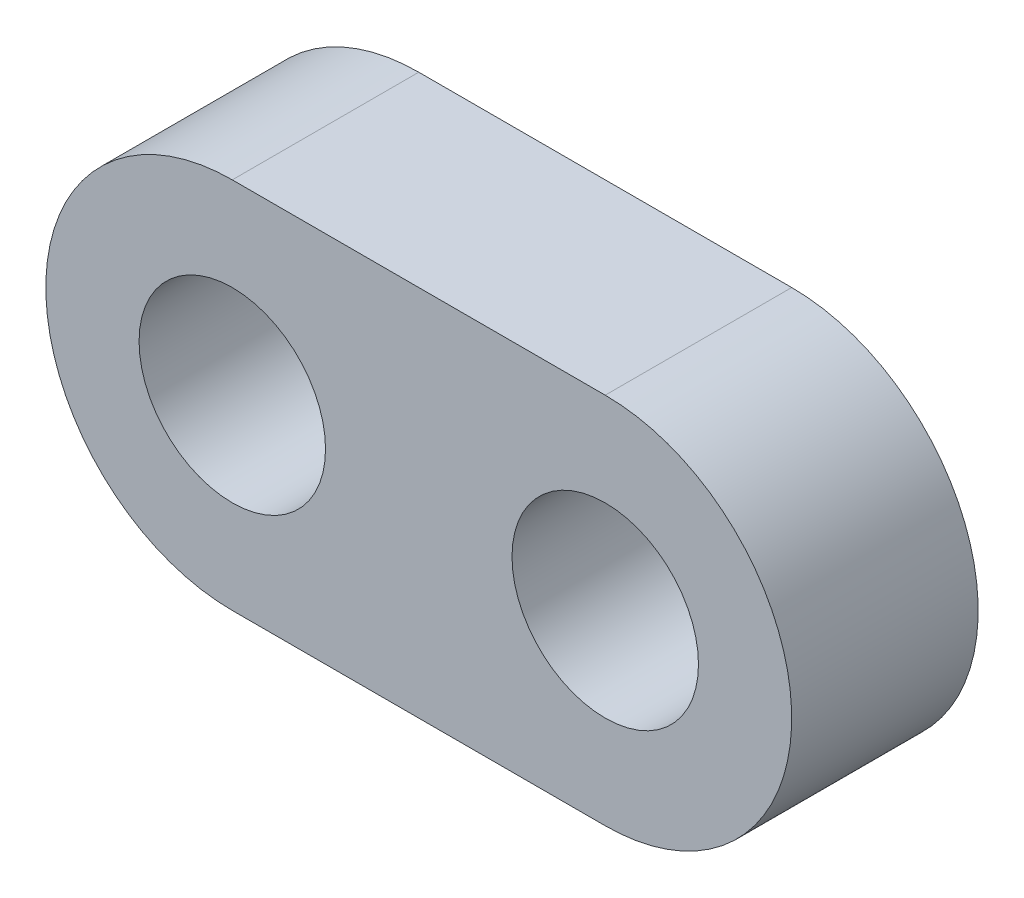
ISO-10303-21;
HEADER;
FILE_DESCRIPTION(('STEP AP214'),'2;1');
FILE_NAME('part.step','',(''),(''),'','','');
FILE_SCHEMA(('AUTOMOTIVE_DESIGN { 1 0 10303 214 1 1 1 1 }'));
ENDSEC;
DATA;
#1=APPLICATION_CONTEXT('core data for automotive mechanical design processes');
#2=APPLICATION_PROTOCOL_DEFINITION('international standard','automotive_design',2000,#1);
#3=PRODUCT_CONTEXT('',#1,'mechanical');
#4=PRODUCT('Part','Part','',(#3));
#5=PRODUCT_RELATED_PRODUCT_CATEGORY('part','',(#4));
#6=PRODUCT_DEFINITION_FORMATION('','',#4);
#7=PRODUCT_DEFINITION_CONTEXT('part definition',#1,'design');
#8=PRODUCT_DEFINITION('design','',#6,#7);
#9=PRODUCT_DEFINITION_SHAPE('','',#8);
#10=(LENGTH_UNIT() NAMED_UNIT(*) SI_UNIT(.MILLI.,.METRE.));
#11=(NAMED_UNIT(*) PLANE_ANGLE_UNIT() SI_UNIT($,.RADIAN.));
#12=(NAMED_UNIT(*) SI_UNIT($,.STERADIAN.) SOLID_ANGLE_UNIT());
#13=UNCERTAINTY_MEASURE_WITH_UNIT(LENGTH_MEASURE(1.E-05),#10,'distance_accuracy_value','');
#14=(GEOMETRIC_REPRESENTATION_CONTEXT(3) GLOBAL_UNCERTAINTY_ASSIGNED_CONTEXT((#13)) GLOBAL_UNIT_ASSIGNED_CONTEXT((#10,
#11,#12)) REPRESENTATION_CONTEXT('',''));
#15=CARTESIAN_POINT('',(0.,0.,0.));
#16=DIRECTION('',(0.,0.,1.));
#17=DIRECTION('',(1.,0.,0.));
#18=AXIS2_PLACEMENT_3D('',#15,#16,#17);
#19=CARTESIAN_POINT('',(0.,0.,6.35));
#20=DIRECTION('',(0.,0.,-1.));
#21=DIRECTION('',(-1.,0.,0.));
#22=AXIS2_PLACEMENT_3D('',#19,#20,#21);
#23=PLANE('',#22);
#24=CARTESIAN_POINT('',(0.,0.,6.35));
#25=DIRECTION('',(0.,0.,1.));
#26=DIRECTION('',(-1.,0.,0.));
#27=AXIS2_PLACEMENT_3D('',#24,#25,#26);
#28=CIRCLE('',#27,6.35);
#29=CARTESIAN_POINT('',(0.,-6.35,6.35));
#30=VERTEX_POINT('',#29);
#31=CARTESIAN_POINT('',(0.,6.35,6.35));
#32=VERTEX_POINT('',#31);
#33=EDGE_CURVE('E95',#30,#32,#28,.T.);
#34=ORIENTED_EDGE('',*,*,#33,.T.);
#35=DIRECTION('',(-1.,0.,0.));
#36=VECTOR('',#35,1.);
#37=CARTESIAN_POINT('',(0.,6.35,6.35));
#38=LINE('',#37,#36);
#39=CARTESIAN_POINT('',(-12.7,6.35,6.35));
#40=VERTEX_POINT('',#39);
#41=EDGE_CURVE('E90',#32,#40,#38,.T.);
#42=ORIENTED_EDGE('',*,*,#41,.T.);
#43=CARTESIAN_POINT('',(-12.7,0.,6.35));
#44=DIRECTION('',(0.,0.,1.));
#45=DIRECTION('',(1.,0.,0.));
#46=AXIS2_PLACEMENT_3D('',#43,#44,#45);
#47=CIRCLE('',#46,6.35);
#48=CARTESIAN_POINT('',(-12.7,-6.35,6.35));
#49=VERTEX_POINT('',#48);
#50=EDGE_CURVE('E93',#40,#49,#47,.T.);
#51=ORIENTED_EDGE('',*,*,#50,.T.);
#52=DIRECTION('',(1.,0.,0.));
#53=VECTOR('',#52,1.);
#54=CARTESIAN_POINT('',(-12.7,-6.35,6.35));
#55=LINE('',#54,#53);
#56=EDGE_CURVE('E60',#49,#30,#55,.T.);
#57=ORIENTED_EDGE('',*,*,#56,.T.);
#58=EDGE_LOOP('',(#34,#42,#51,#57));
#59=FACE_BOUND('',#58,.T.);
#60=CARTESIAN_POINT('',(0.,0.,6.35));
#61=DIRECTION('',(0.,0.,1.));
#62=DIRECTION('',(1.,0.,0.));
#63=AXIS2_PLACEMENT_3D('',#60,#61,#62);
#64=CIRCLE('',#63,3.175);
#65=CARTESIAN_POINT('',(3.175,0.,6.35));
#66=VERTEX_POINT('',#65);
#67=EDGE_CURVE('E110',#66,#66,#64,.T.);
#68=ORIENTED_EDGE('',*,*,#67,.F.);
#69=EDGE_LOOP('',(#68));
#70=FACE_BOUND('',#69,.T.);
#71=CARTESIAN_POINT('',(-12.7,0.,6.35));
#72=DIRECTION('',(0.,0.,1.));
#73=DIRECTION('',(1.,0.,0.));
#74=AXIS2_PLACEMENT_3D('',#71,#72,#73);
#75=CIRCLE('',#74,3.175);
#76=CARTESIAN_POINT('',(-9.525,0.,6.35));
#77=VERTEX_POINT('',#76);
#78=EDGE_CURVE('E125',#77,#77,#75,.T.);
#79=ORIENTED_EDGE('',*,*,#78,.F.);
#80=EDGE_LOOP('',(#79));
#81=FACE_BOUND('',#80,.T.);
#82=ADVANCED_FACE('F43',(#59,#70,#81),#23,.F.);
#83=CARTESIAN_POINT('',(0.,0.,0.));
#84=DIRECTION('',(0.,0.,-1.));
#85=DIRECTION('',(-1.,0.,0.));
#86=AXIS2_PLACEMENT_3D('',#83,#84,#85);
#87=PLANE('',#86);
#88=CARTESIAN_POINT('',(0.,0.,0.));
#89=DIRECTION('',(0.,0.,1.));
#90=DIRECTION('',(1.,0.,0.));
#91=AXIS2_PLACEMENT_3D('',#88,#89,#90);
#92=CIRCLE('',#91,3.175);
#93=CARTESIAN_POINT('',(3.175,0.,0.));
#94=VERTEX_POINT('',#93);
#95=EDGE_CURVE('E122',#94,#94,#92,.T.);
#96=ORIENTED_EDGE('',*,*,#95,.T.);
#97=EDGE_LOOP('',(#96));
#98=FACE_BOUND('',#97,.T.);
#99=CARTESIAN_POINT('',(0.,0.,0.));
#100=DIRECTION('',(0.,0.,1.));
#101=DIRECTION('',(-1.,0.,0.));
#102=AXIS2_PLACEMENT_3D('',#99,#100,#101);
#103=CIRCLE('',#102,6.35);
#104=CARTESIAN_POINT('',(0.,-6.35,0.));
#105=VERTEX_POINT('',#104);
#106=CARTESIAN_POINT('',(0.,6.35,0.));
#107=VERTEX_POINT('',#106);
#108=EDGE_CURVE('E107',#105,#107,#103,.T.);
#109=ORIENTED_EDGE('',*,*,#108,.F.);
#110=DIRECTION('',(1.,0.,0.));
#111=VECTOR('',#110,1.);
#112=CARTESIAN_POINT('',(-12.7,-6.35,0.));
#113=LINE('',#112,#111);
#114=CARTESIAN_POINT('',(-12.7,-6.35,0.));
#115=VERTEX_POINT('',#114);
#116=EDGE_CURVE('E83',#115,#105,#113,.T.);
#117=ORIENTED_EDGE('',*,*,#116,.F.);
#118=CARTESIAN_POINT('',(-12.7,0.,0.));
#119=DIRECTION('',(0.,0.,1.));
#120=DIRECTION('',(1.,0.,0.));
#121=AXIS2_PLACEMENT_3D('',#118,#119,#120);
#122=CIRCLE('',#121,6.35);
#123=CARTESIAN_POINT('',(-12.7,6.35,0.));
#124=VERTEX_POINT('',#123);
#125=EDGE_CURVE('E77',#124,#115,#122,.T.);
#126=ORIENTED_EDGE('',*,*,#125,.F.);
#127=DIRECTION('',(-1.,0.,0.));
#128=VECTOR('',#127,1.);
#129=CARTESIAN_POINT('',(0.,6.35,0.));
#130=LINE('',#129,#128);
#131=EDGE_CURVE('E99',#107,#124,#130,.T.);
#132=ORIENTED_EDGE('',*,*,#131,.F.);
#133=EDGE_LOOP('',(#109,#117,#126,#132));
#134=FACE_BOUND('',#133,.T.);
#135=CARTESIAN_POINT('',(-12.7,0.,0.));
#136=DIRECTION('',(0.,0.,1.));
#137=DIRECTION('',(1.,0.,0.));
#138=AXIS2_PLACEMENT_3D('',#135,#136,#137);
#139=CIRCLE('',#138,3.175);
#140=CARTESIAN_POINT('',(-9.525,0.,0.));
#141=VERTEX_POINT('',#140);
#142=EDGE_CURVE('E128',#141,#141,#139,.T.);
#143=ORIENTED_EDGE('',*,*,#142,.T.);
#144=EDGE_LOOP('',(#143));
#145=FACE_BOUND('',#144,.T.);
#146=ADVANCED_FACE('F118',(#98,#134,#145),#87,.T.);
#147=CARTESIAN_POINT('',(0.,0.,6.35));
#148=DIRECTION('',(0.,0.,-1.));
#149=DIRECTION('',(-1.,0.,0.));
#150=AXIS2_PLACEMENT_3D('',#147,#148,#149);
#151=CYLINDRICAL_SURFACE('',#150,6.35);
#152=ORIENTED_EDGE('',*,*,#108,.T.);
#153=DIRECTION('',(0.,0.,-1.));
#154=VECTOR('',#153,1.);
#155=CARTESIAN_POINT('',(0.,6.35,6.35));
#156=LINE('',#155,#154);
#157=EDGE_CURVE('E13',#32,#107,#156,.T.);
#158=ORIENTED_EDGE('',*,*,#157,.F.);
#159=ORIENTED_EDGE('',*,*,#33,.F.);
#160=DIRECTION('',(0.,0.,-1.));
#161=VECTOR('',#160,1.);
#162=CARTESIAN_POINT('',(0.,-6.35,6.35));
#163=LINE('',#162,#161);
#164=EDGE_CURVE('E103',#30,#105,#163,.T.);
#165=ORIENTED_EDGE('',*,*,#164,.T.);
#166=EDGE_LOOP('',(#152,#158,#159,#165));
#167=FACE_BOUND('',#166,.T.);
#168=ADVANCED_FACE('F45',(#167),#151,.T.);
#169=CARTESIAN_POINT('',(0.,6.35,6.35));
#170=DIRECTION('',(0.,-1.,0.));
#171=DIRECTION('',(1.,0.,0.));
#172=AXIS2_PLACEMENT_3D('',#169,#170,#171);
#173=PLANE('',#172);
#174=ORIENTED_EDGE('',*,*,#131,.T.);
#175=DIRECTION('',(0.,0.,-1.));
#176=VECTOR('',#175,1.);
#177=CARTESIAN_POINT('',(-12.7,6.35,6.35));
#178=LINE('',#177,#176);
#179=EDGE_CURVE('E52',#40,#124,#178,.T.);
#180=ORIENTED_EDGE('',*,*,#179,.F.);
#181=ORIENTED_EDGE('',*,*,#41,.F.);
#182=ORIENTED_EDGE('',*,*,#157,.T.);
#183=EDGE_LOOP('',(#174,#180,#181,#182));
#184=FACE_BOUND('',#183,.T.);
#185=ADVANCED_FACE('F98',(#184),#173,.F.);
#186=CARTESIAN_POINT('',(-12.7,0.,6.35));
#187=DIRECTION('',(0.,0.,-1.));
#188=DIRECTION('',(-1.,0.,0.));
#189=AXIS2_PLACEMENT_3D('',#186,#187,#188);
#190=CYLINDRICAL_SURFACE('',#189,6.35);
#191=ORIENTED_EDGE('',*,*,#125,.T.);
#192=DIRECTION('',(0.,0.,-1.));
#193=VECTOR('',#192,1.);
#194=CARTESIAN_POINT('',(-12.7,-6.35,6.35));
#195=LINE('',#194,#193);
#196=EDGE_CURVE('E100',#49,#115,#195,.T.);
#197=ORIENTED_EDGE('',*,*,#196,.F.);
#198=ORIENTED_EDGE('',*,*,#50,.F.);
#199=ORIENTED_EDGE('',*,*,#179,.T.);
#200=EDGE_LOOP('',(#191,#197,#198,#199));
#201=FACE_BOUND('',#200,.T.);
#202=ADVANCED_FACE('F101',(#201),#190,.T.);
#203=CARTESIAN_POINT('',(-12.7,-6.35,6.35));
#204=DIRECTION('',(0.,1.,0.));
#205=DIRECTION('',(0.,0.,1.));
#206=AXIS2_PLACEMENT_3D('',#203,#204,#205);
#207=PLANE('',#206);
#208=ORIENTED_EDGE('',*,*,#116,.T.);
#209=ORIENTED_EDGE('',*,*,#164,.F.);
#210=ORIENTED_EDGE('',*,*,#56,.F.);
#211=ORIENTED_EDGE('',*,*,#196,.T.);
#212=EDGE_LOOP('',(#208,#209,#210,#211));
#213=FACE_BOUND('',#212,.T.);
#214=ADVANCED_FACE('F115',(#213),#207,.F.);
#215=CARTESIAN_POINT('',(0.,0.,6.35));
#216=DIRECTION('',(0.,0.,-1.));
#217=DIRECTION('',(-1.,0.,0.));
#218=AXIS2_PLACEMENT_3D('',#215,#216,#217);
#219=CYLINDRICAL_SURFACE('',#218,3.175);
#220=ORIENTED_EDGE('',*,*,#67,.T.);
#221=EDGE_LOOP('',(#220));
#222=FACE_BOUND('',#221,.T.);
#223=ORIENTED_EDGE('',*,*,#95,.F.);
#224=EDGE_LOOP('',(#223));
#225=FACE_BOUND('',#224,.T.);
#226=ADVANCED_FACE('F145',(#222,#225),#219,.F.);
#227=CARTESIAN_POINT('',(-12.7,0.,6.35));
#228=DIRECTION('',(0.,0.,-1.));
#229=DIRECTION('',(-1.,0.,0.));
#230=AXIS2_PLACEMENT_3D('',#227,#228,#229);
#231=CYLINDRICAL_SURFACE('',#230,3.175);
#232=ORIENTED_EDGE('',*,*,#78,.T.);
#233=EDGE_LOOP('',(#232));
#234=FACE_BOUND('',#233,.T.);
#235=ORIENTED_EDGE('',*,*,#142,.F.);
#236=EDGE_LOOP('',(#235));
#237=FACE_BOUND('',#236,.T.);
#238=ADVANCED_FACE('F134',(#234,#237),#231,.F.);
#239=CLOSED_SHELL('',(#82,#146,#168,#185,#202,#214,#226,#238));
#240=MANIFOLD_SOLID_BREP('B2',#239);
#241=ADVANCED_BREP_SHAPE_REPRESENTATION('',(#18,#240),#14);
#242=SHAPE_DEFINITION_REPRESENTATION(#9,#241);
ENDSEC;
END-ISO-10303-21;
